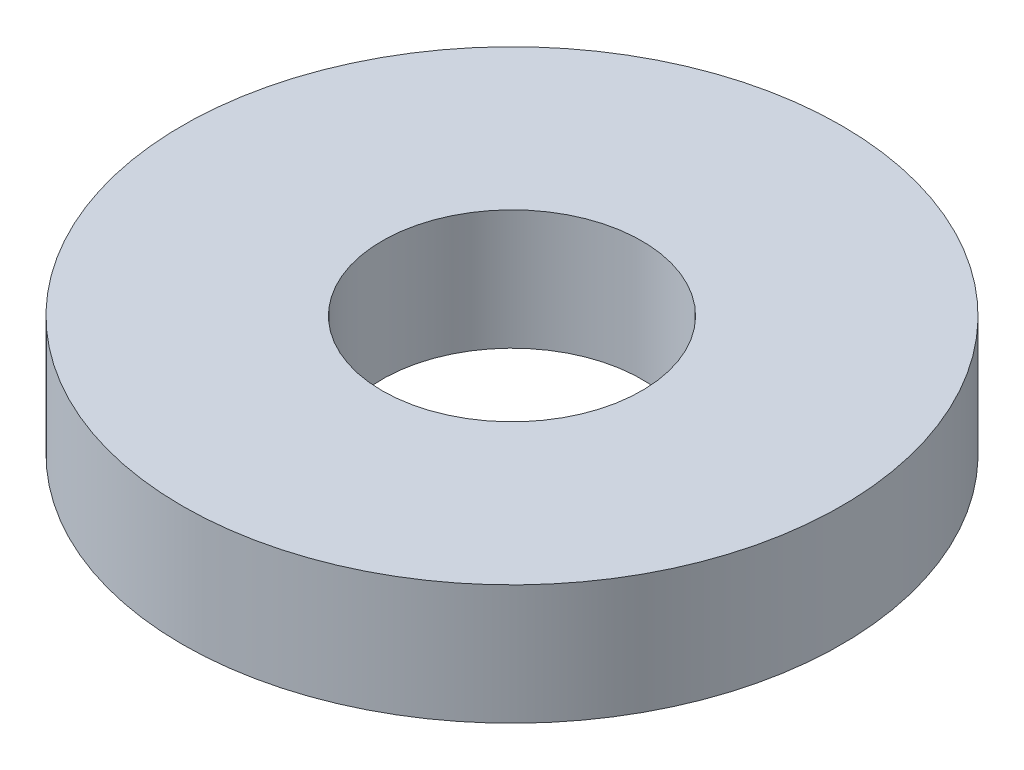
ISO-10303-21;
HEADER;
FILE_DESCRIPTION(('STEP AP214'),'2;1');
FILE_NAME('part.step','',(''),(''),'','','');
FILE_SCHEMA(('AUTOMOTIVE_DESIGN { 1 0 10303 214 1 1 1 1 }'));
ENDSEC;
DATA;
#1=APPLICATION_CONTEXT('core data for automotive mechanical design processes');
#2=APPLICATION_PROTOCOL_DEFINITION('international standard','automotive_design',2000,#1);
#3=PRODUCT_CONTEXT('',#1,'mechanical');
#4=PRODUCT('Part','Part','',(#3));
#5=PRODUCT_RELATED_PRODUCT_CATEGORY('part','',(#4));
#6=PRODUCT_DEFINITION_FORMATION('','',#4);
#7=PRODUCT_DEFINITION_CONTEXT('part definition',#1,'design');
#8=PRODUCT_DEFINITION('design','',#6,#7);
#9=PRODUCT_DEFINITION_SHAPE('','',#8);
#10=(LENGTH_UNIT() NAMED_UNIT(*) SI_UNIT(.MILLI.,.METRE.));
#11=(NAMED_UNIT(*) PLANE_ANGLE_UNIT() SI_UNIT($,.RADIAN.));
#12=(NAMED_UNIT(*) SI_UNIT($,.STERADIAN.) SOLID_ANGLE_UNIT());
#13=UNCERTAINTY_MEASURE_WITH_UNIT(LENGTH_MEASURE(1.E-05),#10,'distance_accuracy_value','');
#14=(GEOMETRIC_REPRESENTATION_CONTEXT(3) GLOBAL_UNCERTAINTY_ASSIGNED_CONTEXT((#13)) GLOBAL_UNIT_ASSIGNED_CONTEXT((#10,
#11,#12)) REPRESENTATION_CONTEXT('',''));
#15=CARTESIAN_POINT('',(0.,0.,0.));
#16=DIRECTION('',(0.,0.,1.));
#17=DIRECTION('',(1.,0.,0.));
#18=AXIS2_PLACEMENT_3D('',#15,#16,#17);
#19=CARTESIAN_POINT('',(0.,30.,0.));
#20=DIRECTION('',(0.,-1.,0.));
#21=DIRECTION('',(0.,0.,-1.));
#22=AXIS2_PLACEMENT_3D('',#19,#20,#21);
#23=CYLINDRICAL_SURFACE('',#22,82.5);
#24=CARTESIAN_POINT('',(0.,30.,0.));
#25=DIRECTION('',(0.,1.,0.));
#26=DIRECTION('',(0.,0.,1.));
#27=AXIS2_PLACEMENT_3D('',#24,#25,#26);
#28=CIRCLE('',#27,82.5);
#29=CARTESIAN_POINT('',(0.,30.,82.5));
#30=VERTEX_POINT('',#29);
#31=EDGE_CURVE('E10',#30,#30,#28,.T.);
#32=ORIENTED_EDGE('',*,*,#31,.F.);
#33=EDGE_LOOP('',(#32));
#34=FACE_BOUND('',#33,.T.);
#35=CARTESIAN_POINT('',(0.,0.,0.));
#36=DIRECTION('',(0.,1.,0.));
#37=DIRECTION('',(0.,0.,1.));
#38=AXIS2_PLACEMENT_3D('',#35,#36,#37);
#39=CIRCLE('',#38,82.5);
#40=CARTESIAN_POINT('',(0.,0.,82.5));
#41=VERTEX_POINT('',#40);
#42=EDGE_CURVE('E37',#41,#41,#39,.T.);
#43=ORIENTED_EDGE('',*,*,#42,.T.);
#44=EDGE_LOOP('',(#43));
#45=FACE_BOUND('',#44,.T.);
#46=ADVANCED_FACE('F40',(#34,#45),#23,.T.);
#47=CARTESIAN_POINT('',(0.,30.,0.));
#48=DIRECTION('',(0.,1.,0.));
#49=DIRECTION('',(0.,0.,1.));
#50=AXIS2_PLACEMENT_3D('',#47,#48,#49);
#51=PLANE('',#50);
#52=CARTESIAN_POINT('',(0.,30.,0.));
#53=DIRECTION('',(0.,1.,0.));
#54=DIRECTION('',(0.,0.,1.));
#55=AXIS2_PLACEMENT_3D('',#52,#53,#54);
#56=CIRCLE('',#55,32.5);
#57=CARTESIAN_POINT('',(0.,30.,32.5));
#58=VERTEX_POINT('',#57);
#59=EDGE_CURVE('E50',#58,#58,#56,.T.);
#60=ORIENTED_EDGE('',*,*,#59,.F.);
#61=EDGE_LOOP('',(#60));
#62=FACE_BOUND('',#61,.T.);
#63=ORIENTED_EDGE('',*,*,#31,.T.);
#64=EDGE_LOOP('',(#63));
#65=FACE_BOUND('',#64,.T.);
#66=ADVANCED_FACE('F59',(#62,#65),#51,.T.);
#67=CARTESIAN_POINT('',(0.,0.,0.));
#68=DIRECTION('',(0.,1.,0.));
#69=DIRECTION('',(0.,0.,1.));
#70=AXIS2_PLACEMENT_3D('',#67,#68,#69);
#71=PLANE('',#70);
#72=CARTESIAN_POINT('',(0.,0.,0.));
#73=DIRECTION('',(0.,1.,0.));
#74=DIRECTION('',(0.,0.,1.));
#75=AXIS2_PLACEMENT_3D('',#72,#73,#74);
#76=CIRCLE('',#75,32.5);
#77=CARTESIAN_POINT('',(0.,0.,32.5));
#78=VERTEX_POINT('',#77);
#79=EDGE_CURVE('E47',#78,#78,#76,.T.);
#80=ORIENTED_EDGE('',*,*,#79,.T.);
#81=EDGE_LOOP('',(#80));
#82=FACE_BOUND('',#81,.T.);
#83=ORIENTED_EDGE('',*,*,#42,.F.);
#84=EDGE_LOOP('',(#83));
#85=FACE_BOUND('',#84,.T.);
#86=ADVANCED_FACE('F58',(#82,#85),#71,.F.);
#87=CARTESIAN_POINT('',(0.,30.,0.));
#88=DIRECTION('',(0.,-1.,0.));
#89=DIRECTION('',(0.,0.,-1.));
#90=AXIS2_PLACEMENT_3D('',#87,#88,#89);
#91=CYLINDRICAL_SURFACE('',#90,32.5);
#92=ORIENTED_EDGE('',*,*,#59,.T.);
#93=EDGE_LOOP('',(#92));
#94=FACE_BOUND('',#93,.T.);
#95=ORIENTED_EDGE('',*,*,#79,.F.);
#96=EDGE_LOOP('',(#95));
#97=FACE_BOUND('',#96,.T.);
#98=ADVANCED_FACE('F54',(#94,#97),#91,.F.);
#99=CLOSED_SHELL('',(#46,#66,#86,#98));
#100=MANIFOLD_SOLID_BREP('B2',#99);
#101=ADVANCED_BREP_SHAPE_REPRESENTATION('',(#18,#100),#14);
#102=SHAPE_DEFINITION_REPRESENTATION(#9,#101);
ENDSEC;
END-ISO-10303-21;
